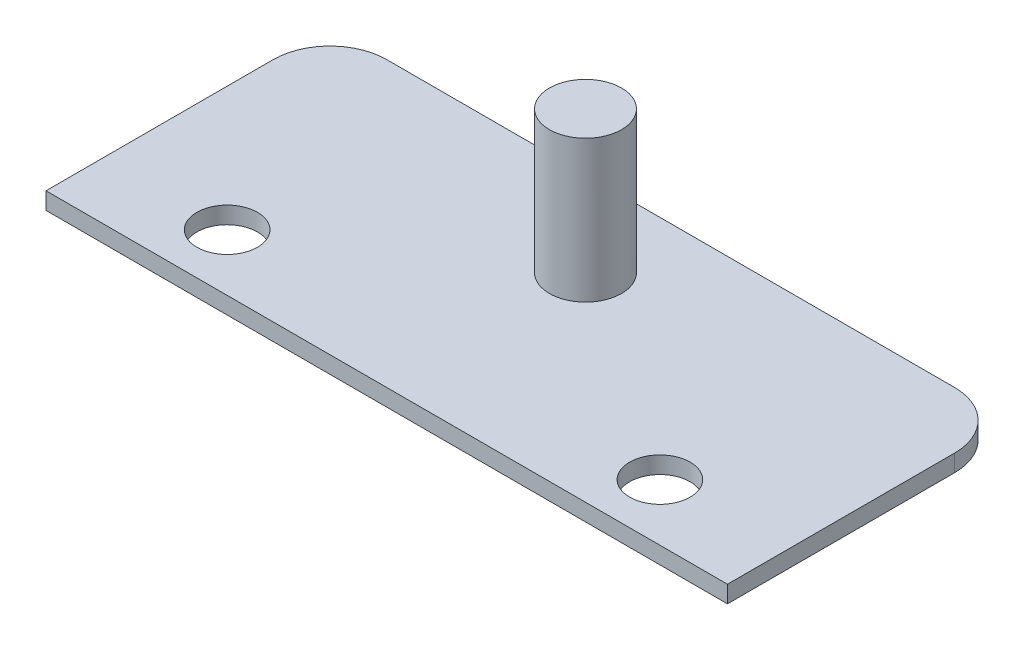
ISO-10303-21;
HEADER;
FILE_DESCRIPTION(('STEP AP214'),'2;1');
FILE_NAME('part.step','',(''),(''),'','','');
FILE_SCHEMA(('AUTOMOTIVE_DESIGN { 1 0 10303 214 1 1 1 1 }'));
ENDSEC;
DATA;
#1=APPLICATION_CONTEXT('core data for automotive mechanical design processes');
#2=APPLICATION_PROTOCOL_DEFINITION('international standard','automotive_design',2000,#1);
#3=PRODUCT_CONTEXT('',#1,'mechanical');
#4=PRODUCT('Part','Part','',(#3));
#5=PRODUCT_RELATED_PRODUCT_CATEGORY('part','',(#4));
#6=PRODUCT_DEFINITION_FORMATION('','',#4);
#7=PRODUCT_DEFINITION_CONTEXT('part definition',#1,'design');
#8=PRODUCT_DEFINITION('design','',#6,#7);
#9=PRODUCT_DEFINITION_SHAPE('','',#8);
#10=(LENGTH_UNIT() NAMED_UNIT(*) SI_UNIT(.MILLI.,.METRE.));
#11=(NAMED_UNIT(*) PLANE_ANGLE_UNIT() SI_UNIT($,.RADIAN.));
#12=(NAMED_UNIT(*) SI_UNIT($,.STERADIAN.) SOLID_ANGLE_UNIT());
#13=UNCERTAINTY_MEASURE_WITH_UNIT(LENGTH_MEASURE(1.E-05),#10,'distance_accuracy_value','');
#14=(GEOMETRIC_REPRESENTATION_CONTEXT(3) GLOBAL_UNCERTAINTY_ASSIGNED_CONTEXT((#13)) GLOBAL_UNIT_ASSIGNED_CONTEXT((#10,
#11,#12)) REPRESENTATION_CONTEXT('',''));
#15=CARTESIAN_POINT('',(0.,0.,0.));
#16=DIRECTION('',(0.,0.,1.));
#17=DIRECTION('',(1.,0.,0.));
#18=AXIS2_PLACEMENT_3D('',#15,#16,#17);
#19=CARTESIAN_POINT('',(0.,3.,0.));
#20=DIRECTION('',(1.,0.,0.));
#21=DIRECTION('',(0.,0.,-1.));
#22=AXIS2_PLACEMENT_3D('',#19,#20,#21);
#23=PLANE('',#22);
#24=DIRECTION('',(0.,0.,1.));
#25=VECTOR('',#24,1.);
#26=CARTESIAN_POINT('',(0.,3.,0.));
#27=LINE('',#26,#25);
#28=CARTESIAN_POINT('',(0.,3.,-40.));
#29=VERTEX_POINT('',#28);
#30=CARTESIAN_POINT('',(0.,3.,0.));
#31=VERTEX_POINT('',#30);
#32=EDGE_CURVE('E99',#29,#31,#27,.T.);
#33=ORIENTED_EDGE('',*,*,#32,.F.);
#34=DIRECTION('',(0.,-1.,0.));
#35=VECTOR('',#34,1.);
#36=CARTESIAN_POINT('',(0.,3.,-40.));
#37=LINE('',#36,#35);
#38=CARTESIAN_POINT('',(0.,0.,-40.));
#39=VERTEX_POINT('',#38);
#40=EDGE_CURVE('E11',#29,#39,#37,.T.);
#41=ORIENTED_EDGE('',*,*,#40,.T.);
#42=DIRECTION('',(0.,0.,1.));
#43=VECTOR('',#42,1.);
#44=CARTESIAN_POINT('',(0.,0.,0.));
#45=LINE('',#44,#43);
#46=CARTESIAN_POINT('',(0.,0.,0.));
#47=VERTEX_POINT('',#46);
#48=EDGE_CURVE('E120',#39,#47,#45,.T.);
#49=ORIENTED_EDGE('',*,*,#48,.T.);
#50=DIRECTION('',(0.,-1.,0.));
#51=VECTOR('',#50,1.);
#52=CARTESIAN_POINT('',(0.,3.,0.));
#53=LINE('',#52,#51);
#54=EDGE_CURVE('E113',#31,#47,#53,.T.);
#55=ORIENTED_EDGE('',*,*,#54,.F.);
#56=EDGE_LOOP('',(#33,#41,#49,#55));
#57=FACE_BOUND('',#56,.T.);
#58=ADVANCED_FACE('F45',(#57),#23,.F.);
#59=CARTESIAN_POINT('',(0.,3.,0.));
#60=DIRECTION('',(0.,0.,-1.));
#61=DIRECTION('',(-1.,0.,0.));
#62=AXIS2_PLACEMENT_3D('',#59,#60,#61);
#63=PLANE('',#62);
#64=DIRECTION('',(1.,0.,0.));
#65=VECTOR('',#64,1.);
#66=CARTESIAN_POINT('',(0.,0.,0.));
#67=LINE('',#66,#65);
#68=CARTESIAN_POINT('',(120.,0.,0.));
#69=VERTEX_POINT('',#68);
#70=EDGE_CURVE('E168',#47,#69,#67,.T.);
#71=ORIENTED_EDGE('',*,*,#70,.T.);
#72=DIRECTION('',(0.,-1.,0.));
#73=VECTOR('',#72,1.);
#74=CARTESIAN_POINT('',(120.,3.,0.));
#75=LINE('',#74,#73);
#76=CARTESIAN_POINT('',(120.,3.,0.));
#77=VERTEX_POINT('',#76);
#78=EDGE_CURVE('E115',#77,#69,#75,.T.);
#79=ORIENTED_EDGE('',*,*,#78,.F.);
#80=DIRECTION('',(1.,0.,0.));
#81=VECTOR('',#80,1.);
#82=CARTESIAN_POINT('',(0.,3.,0.));
#83=LINE('',#82,#81);
#84=EDGE_CURVE('E102',#31,#77,#83,.T.);
#85=ORIENTED_EDGE('',*,*,#84,.F.);
#86=ORIENTED_EDGE('',*,*,#54,.T.);
#87=EDGE_LOOP('',(#71,#79,#85,#86));
#88=FACE_BOUND('',#87,.T.);
#89=ADVANCED_FACE('F112',(#88),#63,.F.);
#90=CARTESIAN_POINT('',(120.,3.,0.));
#91=DIRECTION('',(-1.,0.,0.));
#92=DIRECTION('',(0.,0.,1.));
#93=AXIS2_PLACEMENT_3D('',#90,#91,#92);
#94=PLANE('',#93);
#95=DIRECTION('',(0.,0.,-1.));
#96=VECTOR('',#95,1.);
#97=CARTESIAN_POINT('',(120.,0.,0.));
#98=LINE('',#97,#96);
#99=CARTESIAN_POINT('',(120.,0.,-40.));
#100=VERTEX_POINT('',#99);
#101=EDGE_CURVE('E165',#69,#100,#98,.T.);
#102=ORIENTED_EDGE('',*,*,#101,.T.);
#103=DIRECTION('',(0.,-1.,0.));
#104=VECTOR('',#103,1.);
#105=CARTESIAN_POINT('',(120.,3.,-40.));
#106=LINE('',#105,#104);
#107=CARTESIAN_POINT('',(120.,3.,-40.));
#108=VERTEX_POINT('',#107);
#109=EDGE_CURVE('E69',#100,#108,#106,.F.);
#110=ORIENTED_EDGE('',*,*,#109,.T.);
#111=DIRECTION('',(0.,0.,-1.));
#112=VECTOR('',#111,1.);
#113=CARTESIAN_POINT('',(120.,3.,0.));
#114=LINE('',#113,#112);
#115=EDGE_CURVE('E117',#77,#108,#114,.T.);
#116=ORIENTED_EDGE('',*,*,#115,.F.);
#117=ORIENTED_EDGE('',*,*,#78,.T.);
#118=EDGE_LOOP('',(#102,#110,#116,#117));
#119=FACE_BOUND('',#118,.T.);
#120=ADVANCED_FACE('F166',(#119),#94,.F.);
#121=CARTESIAN_POINT('',(0.,3.,-50.));
#122=DIRECTION('',(0.,0.,1.));
#123=DIRECTION('',(1.,0.,0.));
#124=AXIS2_PLACEMENT_3D('',#121,#122,#123);
#125=PLANE('',#124);
#126=DIRECTION('',(-1.,0.,0.));
#127=VECTOR('',#126,1.);
#128=CARTESIAN_POINT('',(0.,3.,-50.));
#129=LINE('',#128,#127);
#130=CARTESIAN_POINT('',(110.,3.,-50.));
#131=VERTEX_POINT('',#130);
#132=CARTESIAN_POINT('',(10.,3.,-50.));
#133=VERTEX_POINT('',#132);
#134=EDGE_CURVE('E130',#131,#133,#129,.T.);
#135=ORIENTED_EDGE('',*,*,#134,.F.);
#136=DIRECTION('',(0.,-1.,0.));
#137=VECTOR('',#136,1.);
#138=CARTESIAN_POINT('',(110.,3.,-50.));
#139=LINE('',#138,#137);
#140=CARTESIAN_POINT('',(110.,0.,-50.));
#141=VERTEX_POINT('',#140);
#142=EDGE_CURVE('E136',#131,#141,#139,.T.);
#143=ORIENTED_EDGE('',*,*,#142,.T.);
#144=DIRECTION('',(-1.,0.,0.));
#145=VECTOR('',#144,1.);
#146=CARTESIAN_POINT('',(0.,0.,-50.));
#147=LINE('',#146,#145);
#148=CARTESIAN_POINT('',(10.,0.,-50.));
#149=VERTEX_POINT('',#148);
#150=EDGE_CURVE('E108',#141,#149,#147,.T.);
#151=ORIENTED_EDGE('',*,*,#150,.T.);
#152=DIRECTION('',(0.,-1.,0.));
#153=VECTOR('',#152,1.);
#154=CARTESIAN_POINT('',(10.,3.,-50.));
#155=LINE('',#154,#153);
#156=EDGE_CURVE('E128',#149,#133,#155,.F.);
#157=ORIENTED_EDGE('',*,*,#156,.T.);
#158=EDGE_LOOP('',(#135,#143,#151,#157));
#159=FACE_BOUND('',#158,.T.);
#160=ADVANCED_FACE('F155',(#159),#125,.F.);
#161=CARTESIAN_POINT('',(0.,3.,0.));
#162=DIRECTION('',(0.,-1.,0.));
#163=DIRECTION('',(0.,0.,-1.));
#164=AXIS2_PLACEMENT_3D('',#161,#162,#163);
#165=PLANE('',#164);
#166=CARTESIAN_POINT('',(60.,3.,-35.));
#167=DIRECTION('',(0.,-1.,0.));
#168=DIRECTION('',(0.,0.,-1.));
#169=AXIS2_PLACEMENT_3D('',#166,#167,#168);
#170=CIRCLE('',#169,6.35);
#171=CARTESIAN_POINT('',(60.,3.,-41.35));
#172=VERTEX_POINT('',#171);
#173=EDGE_CURVE('E123',#172,#172,#170,.F.);
#174=ORIENTED_EDGE('',*,*,#173,.F.);
#175=EDGE_LOOP('',(#174));
#176=FACE_BOUND('',#175,.T.);
#177=CARTESIAN_POINT('',(21.9,3.,-10.));
#178=DIRECTION('',(0.,1.,0.));
#179=DIRECTION('',(0.,0.,1.));
#180=AXIS2_PLACEMENT_3D('',#177,#178,#179);
#181=CIRCLE('',#180,5.334);
#182=CARTESIAN_POINT('',(21.9,3.,-4.666));
#183=VERTEX_POINT('',#182);
#184=EDGE_CURVE('E188',#183,#183,#181,.T.);
#185=ORIENTED_EDGE('',*,*,#184,.F.);
#186=EDGE_LOOP('',(#185));
#187=FACE_BOUND('',#186,.T.);
#188=CARTESIAN_POINT('',(98.1,3.,-10.));
#189=DIRECTION('',(0.,1.,0.));
#190=DIRECTION('',(0.,0.,1.));
#191=AXIS2_PLACEMENT_3D('',#188,#189,#190);
#192=CIRCLE('',#191,5.33400000000001);
#193=CARTESIAN_POINT('',(98.1,3.,-4.666));
#194=VERTEX_POINT('',#193);
#195=EDGE_CURVE('E183',#194,#194,#192,.T.);
#196=ORIENTED_EDGE('',*,*,#195,.F.);
#197=EDGE_LOOP('',(#196));
#198=FACE_BOUND('',#197,.T.);
#199=ORIENTED_EDGE('',*,*,#115,.T.);
#200=CARTESIAN_POINT('',(110.,3.,-40.));
#201=DIRECTION('',(0.,-1.,0.));
#202=DIRECTION('',(0.,0.,-1.));
#203=AXIS2_PLACEMENT_3D('',#200,#201,#202);
#204=CIRCLE('',#203,10.);
#205=EDGE_CURVE('E54',#108,#131,#204,.F.);
#206=ORIENTED_EDGE('',*,*,#205,.T.);
#207=ORIENTED_EDGE('',*,*,#134,.T.);
#208=CARTESIAN_POINT('',(10.,3.,-40.));
#209=DIRECTION('',(0.,-1.,0.));
#210=DIRECTION('',(0.,0.,-1.));
#211=AXIS2_PLACEMENT_3D('',#208,#209,#210);
#212=CIRCLE('',#211,10.);
#213=EDGE_CURVE('E61',#133,#29,#212,.F.);
#214=ORIENTED_EDGE('',*,*,#213,.T.);
#215=ORIENTED_EDGE('',*,*,#32,.T.);
#216=ORIENTED_EDGE('',*,*,#84,.T.);
#217=EDGE_LOOP('',(#199,#206,#207,#214,#215,#216));
#218=FACE_BOUND('',#217,.T.);
#219=ADVANCED_FACE('F101',(#176,#187,#198,#218),#165,.F.);
#220=CARTESIAN_POINT('',(0.,0.,0.));
#221=DIRECTION('',(0.,-1.,0.));
#222=DIRECTION('',(0.,0.,-1.));
#223=AXIS2_PLACEMENT_3D('',#220,#221,#222);
#224=PLANE('',#223);
#225=CARTESIAN_POINT('',(21.9,0.,-10.));
#226=DIRECTION('',(0.,1.,0.));
#227=DIRECTION('',(0.,0.,1.));
#228=AXIS2_PLACEMENT_3D('',#225,#226,#227);
#229=CIRCLE('',#228,5.334);
#230=CARTESIAN_POINT('',(21.9,0.,-4.666));
#231=VERTEX_POINT('',#230);
#232=EDGE_CURVE('E175',#231,#231,#229,.T.);
#233=ORIENTED_EDGE('',*,*,#232,.T.);
#234=EDGE_LOOP('',(#233));
#235=FACE_BOUND('',#234,.T.);
#236=CARTESIAN_POINT('',(98.1,0.,-10.));
#237=DIRECTION('',(0.,1.,0.));
#238=DIRECTION('',(0.,0.,1.));
#239=AXIS2_PLACEMENT_3D('',#236,#237,#238);
#240=CIRCLE('',#239,5.33400000000001);
#241=CARTESIAN_POINT('',(98.1,0.,-4.666));
#242=VERTEX_POINT('',#241);
#243=EDGE_CURVE('E179',#242,#242,#240,.T.);
#244=ORIENTED_EDGE('',*,*,#243,.T.);
#245=EDGE_LOOP('',(#244));
#246=FACE_BOUND('',#245,.T.);
#247=ORIENTED_EDGE('',*,*,#150,.F.);
#248=CARTESIAN_POINT('',(110.,0.,-40.));
#249=DIRECTION('',(0.,-1.,0.));
#250=DIRECTION('',(0.,0.,-1.));
#251=AXIS2_PLACEMENT_3D('',#248,#249,#250);
#252=CIRCLE('',#251,10.);
#253=EDGE_CURVE('E143',#141,#100,#252,.T.);
#254=ORIENTED_EDGE('',*,*,#253,.T.);
#255=ORIENTED_EDGE('',*,*,#101,.F.);
#256=ORIENTED_EDGE('',*,*,#70,.F.);
#257=ORIENTED_EDGE('',*,*,#48,.F.);
#258=CARTESIAN_POINT('',(10.,0.,-40.));
#259=DIRECTION('',(0.,-1.,0.));
#260=DIRECTION('',(0.,0.,-1.));
#261=AXIS2_PLACEMENT_3D('',#258,#259,#260);
#262=CIRCLE('',#261,10.);
#263=EDGE_CURVE('E140',#39,#149,#262,.T.);
#264=ORIENTED_EDGE('',*,*,#263,.T.);
#265=EDGE_LOOP('',(#247,#254,#255,#256,#257,#264));
#266=FACE_BOUND('',#265,.T.);
#267=ADVANCED_FACE('F164',(#235,#246,#266),#224,.T.);
#268=CARTESIAN_POINT('',(98.1,0.,-10.));
#269=DIRECTION('',(0.,1.,0.));
#270=DIRECTION('',(0.,0.,1.));
#271=AXIS2_PLACEMENT_3D('',#268,#269,#270);
#272=CYLINDRICAL_SURFACE('',#271,5.33400000000001);
#273=ORIENTED_EDGE('',*,*,#243,.F.);
#274=EDGE_LOOP('',(#273));
#275=FACE_BOUND('',#274,.T.);
#276=ORIENTED_EDGE('',*,*,#195,.T.);
#277=EDGE_LOOP('',(#276));
#278=FACE_BOUND('',#277,.T.);
#279=ADVANCED_FACE('F215',(#275,#278),#272,.F.);
#280=CARTESIAN_POINT('',(21.9,0.,-10.));
#281=DIRECTION('',(0.,1.,0.));
#282=DIRECTION('',(0.,0.,1.));
#283=AXIS2_PLACEMENT_3D('',#280,#281,#282);
#284=CYLINDRICAL_SURFACE('',#283,5.334);
#285=ORIENTED_EDGE('',*,*,#232,.F.);
#286=EDGE_LOOP('',(#285));
#287=FACE_BOUND('',#286,.T.);
#288=ORIENTED_EDGE('',*,*,#184,.T.);
#289=EDGE_LOOP('',(#288));
#290=FACE_BOUND('',#289,.T.);
#291=ADVANCED_FACE('F204',(#287,#290),#284,.F.);
#292=CARTESIAN_POINT('',(60.,28.,-35.));
#293=DIRECTION('',(0.,-1.,0.));
#294=DIRECTION('',(0.,0.,-1.));
#295=AXIS2_PLACEMENT_3D('',#292,#293,#294);
#296=CYLINDRICAL_SURFACE('',#295,6.35);
#297=CARTESIAN_POINT('',(60.,28.,-35.));
#298=DIRECTION('',(0.,1.,0.));
#299=DIRECTION('',(0.,0.,1.));
#300=AXIS2_PLACEMENT_3D('',#297,#298,#299);
#301=CIRCLE('',#300,6.35);
#302=CARTESIAN_POINT('',(60.,28.,-28.65));
#303=VERTEX_POINT('',#302);
#304=EDGE_CURVE('E184',#303,#303,#301,.T.);
#305=ORIENTED_EDGE('',*,*,#304,.F.);
#306=EDGE_LOOP('',(#305));
#307=FACE_BOUND('',#306,.T.);
#308=ORIENTED_EDGE('',*,*,#173,.T.);
#309=EDGE_LOOP('',(#308));
#310=FACE_BOUND('',#309,.T.);
#311=ADVANCED_FACE('F201',(#307,#310),#296,.T.);
#312=CARTESIAN_POINT('',(60.,28.,-35.));
#313=DIRECTION('',(0.,1.,0.));
#314=DIRECTION('',(0.,0.,1.));
#315=AXIS2_PLACEMENT_3D('',#312,#313,#314);
#316=PLANE('',#315);
#317=ORIENTED_EDGE('',*,*,#304,.T.);
#318=EDGE_LOOP('',(#317));
#319=FACE_BOUND('',#318,.T.);
#320=ADVANCED_FACE('F199',(#319),#316,.T.);
#321=CARTESIAN_POINT('',(110.,3.,-40.));
#322=DIRECTION('',(0.,-1.,0.));
#323=DIRECTION('',(0.,0.,-1.));
#324=AXIS2_PLACEMENT_3D('',#321,#322,#323);
#325=CYLINDRICAL_SURFACE('',#324,10.);
#326=ORIENTED_EDGE('',*,*,#205,.F.);
#327=ORIENTED_EDGE('',*,*,#109,.F.);
#328=ORIENTED_EDGE('',*,*,#253,.F.);
#329=ORIENTED_EDGE('',*,*,#142,.F.);
#330=EDGE_LOOP('',(#326,#327,#328,#329));
#331=FACE_BOUND('',#330,.T.);
#332=ADVANCED_FACE('F161',(#331),#325,.T.);
#333=CARTESIAN_POINT('',(10.,3.,-40.));
#334=DIRECTION('',(0.,-1.,0.));
#335=DIRECTION('',(0.,0.,-1.));
#336=AXIS2_PLACEMENT_3D('',#333,#334,#335);
#337=CYLINDRICAL_SURFACE('',#336,10.);
#338=ORIENTED_EDGE('',*,*,#213,.F.);
#339=ORIENTED_EDGE('',*,*,#156,.F.);
#340=ORIENTED_EDGE('',*,*,#263,.F.);
#341=ORIENTED_EDGE('',*,*,#40,.F.);
#342=EDGE_LOOP('',(#338,#339,#340,#341));
#343=FACE_BOUND('',#342,.T.);
#344=ADVANCED_FACE('F47',(#343),#337,.T.);
#345=CLOSED_SHELL('',(#58,#89,#120,#160,#219,#267,#279,#291,#311,#320,#332,#344));
#346=MANIFOLD_SOLID_BREP('B2',#345);
#347=ADVANCED_BREP_SHAPE_REPRESENTATION('',(#18,#346),#14);
#348=SHAPE_DEFINITION_REPRESENTATION(#9,#347);
ENDSEC;
END-ISO-10303-21;
